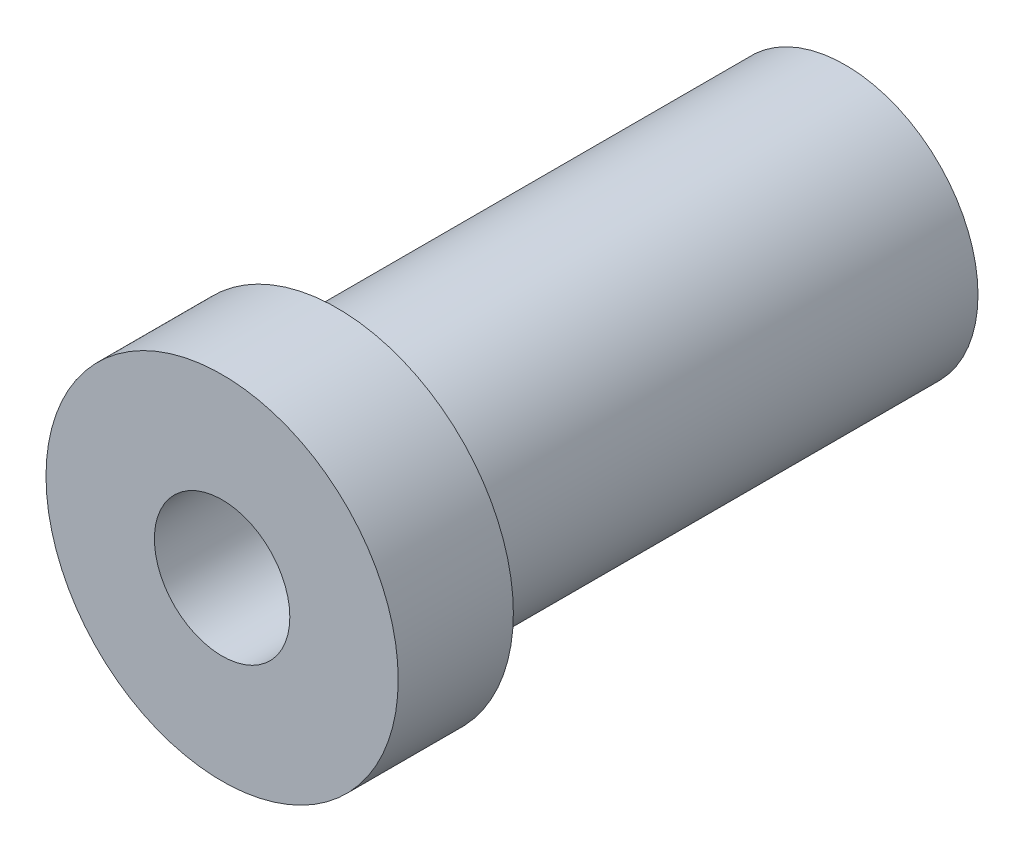
ISO-10303-21;
HEADER;
FILE_DESCRIPTION(('STEP AP214'),'2;1');
FILE_NAME('part.step','',(''),(''),'','','');
FILE_SCHEMA(('AUTOMOTIVE_DESIGN { 1 0 10303 214 1 1 1 1 }'));
ENDSEC;
DATA;
#1=APPLICATION_CONTEXT('core data for automotive mechanical design processes');
#2=APPLICATION_PROTOCOL_DEFINITION('international standard','automotive_design',2000,#1);
#3=PRODUCT_CONTEXT('',#1,'mechanical');
#4=PRODUCT('Part','Part','',(#3));
#5=PRODUCT_RELATED_PRODUCT_CATEGORY('part','',(#4));
#6=PRODUCT_DEFINITION_FORMATION('','',#4);
#7=PRODUCT_DEFINITION_CONTEXT('part definition',#1,'design');
#8=PRODUCT_DEFINITION('design','',#6,#7);
#9=PRODUCT_DEFINITION_SHAPE('','',#8);
#10=(LENGTH_UNIT() NAMED_UNIT(*) SI_UNIT(.MILLI.,.METRE.));
#11=(NAMED_UNIT(*) PLANE_ANGLE_UNIT() SI_UNIT($,.RADIAN.));
#12=(NAMED_UNIT(*) SI_UNIT($,.STERADIAN.) SOLID_ANGLE_UNIT());
#13=UNCERTAINTY_MEASURE_WITH_UNIT(LENGTH_MEASURE(1.E-05),#10,'distance_accuracy_value','');
#14=(GEOMETRIC_REPRESENTATION_CONTEXT(3) GLOBAL_UNCERTAINTY_ASSIGNED_CONTEXT((#13)) GLOBAL_UNIT_ASSIGNED_CONTEXT((#10,
#11,#12)) REPRESENTATION_CONTEXT('',''));
#15=CARTESIAN_POINT('',(0.,0.,0.));
#16=DIRECTION('',(0.,0.,1.));
#17=DIRECTION('',(1.,0.,0.));
#18=AXIS2_PLACEMENT_3D('',#15,#16,#17);
#19=CARTESIAN_POINT('',(0.,4.9,-18.75));
#20=DIRECTION('',(0.,0.,1.));
#21=DIRECTION('',(1.,0.,0.));
#22=AXIS2_PLACEMENT_3D('',#19,#20,#21);
#23=PLANE('',#22);
#24=CARTESIAN_POINT('',(0.,0.,-18.75));
#25=DIRECTION('',(0.,0.,-1.));
#26=DIRECTION('',(-1.,0.,0.));
#27=AXIS2_PLACEMENT_3D('',#24,#25,#26);
#28=CIRCLE('',#27,2.49999999999999);
#29=CARTESIAN_POINT('',(-2.49999999999999,0.,-18.75));
#30=VERTEX_POINT('',#29);
#31=EDGE_CURVE('E68',#30,#30,#28,.T.);
#32=ORIENTED_EDGE('',*,*,#31,.F.);
#33=EDGE_LOOP('',(#32));
#34=FACE_BOUND('',#33,.T.);
#35=CARTESIAN_POINT('',(0.,0.,-18.75));
#36=DIRECTION('',(0.,0.,1.));
#37=DIRECTION('',(1.,0.,0.));
#38=AXIS2_PLACEMENT_3D('',#35,#36,#37);
#39=CIRCLE('',#38,4.9);
#40=CARTESIAN_POINT('',(4.9,0.,-18.75));
#41=VERTEX_POINT('',#40);
#42=EDGE_CURVE('E60',#41,#41,#39,.T.);
#43=ORIENTED_EDGE('',*,*,#42,.F.);
#44=EDGE_LOOP('',(#43));
#45=FACE_BOUND('',#44,.T.);
#46=ADVANCED_FACE('F46',(#34,#45),#23,.F.);
#47=CARTESIAN_POINT('',(0.,0.,4.25));
#48=DIRECTION('',(0.,0.,-1.));
#49=DIRECTION('',(-1.,0.,0.));
#50=AXIS2_PLACEMENT_3D('',#47,#48,#49);
#51=PLANE('',#50);
#52=CARTESIAN_POINT('',(0.,0.,4.25));
#53=DIRECTION('',(0.,0.,1.));
#54=DIRECTION('',(1.,0.,0.));
#55=AXIS2_PLACEMENT_3D('',#52,#53,#54);
#56=CIRCLE('',#55,2.5);
#57=CARTESIAN_POINT('',(2.5,0.,4.25));
#58=VERTEX_POINT('',#57);
#59=EDGE_CURVE('E65',#58,#58,#56,.T.);
#60=ORIENTED_EDGE('',*,*,#59,.F.);
#61=EDGE_LOOP('',(#60));
#62=FACE_BOUND('',#61,.T.);
#63=CARTESIAN_POINT('',(0.,0.,4.24999999999998));
#64=DIRECTION('',(0.,0.,1.));
#65=DIRECTION('',(1.,0.,0.));
#66=AXIS2_PLACEMENT_3D('',#63,#64,#65);
#67=CIRCLE('',#66,6.5);
#68=CARTESIAN_POINT('',(6.5,0.,4.24999999999998));
#69=VERTEX_POINT('',#68);
#70=EDGE_CURVE('E12',#69,#69,#67,.T.);
#71=ORIENTED_EDGE('',*,*,#70,.T.);
#72=EDGE_LOOP('',(#71));
#73=FACE_BOUND('',#72,.T.);
#74=ADVANCED_FACE('F76',(#62,#73),#51,.F.);
#75=CARTESIAN_POINT('',(0.,0.,1000.));
#76=DIRECTION('',(0.,0.,1.));
#77=DIRECTION('',(1.,0.,0.));
#78=AXIS2_PLACEMENT_3D('',#75,#76,#77);
#79=CYLINDRICAL_SURFACE('',#78,6.5);
#80=ORIENTED_EDGE('',*,*,#70,.F.);
#81=EDGE_LOOP('',(#80));
#82=FACE_BOUND('',#81,.T.);
#83=CARTESIAN_POINT('',(0.,0.,0.));
#84=DIRECTION('',(0.,0.,1.));
#85=DIRECTION('',(1.,0.,0.));
#86=AXIS2_PLACEMENT_3D('',#83,#84,#85);
#87=CIRCLE('',#86,6.5);
#88=CARTESIAN_POINT('',(6.5,0.,0.));
#89=VERTEX_POINT('',#88);
#90=EDGE_CURVE('E52',#89,#89,#87,.T.);
#91=ORIENTED_EDGE('',*,*,#90,.T.);
#92=EDGE_LOOP('',(#91));
#93=FACE_BOUND('',#92,.T.);
#94=ADVANCED_FACE('F90',(#82,#93),#79,.T.);
#95=CARTESIAN_POINT('',(0.,6.5,0.));
#96=DIRECTION('',(0.,0.,1.));
#97=DIRECTION('',(1.,0.,0.));
#98=AXIS2_PLACEMENT_3D('',#95,#96,#97);
#99=PLANE('',#98);
#100=ORIENTED_EDGE('',*,*,#90,.F.);
#101=EDGE_LOOP('',(#100));
#102=FACE_BOUND('',#101,.T.);
#103=CARTESIAN_POINT('',(0.,0.,0.));
#104=DIRECTION('',(0.,0.,1.));
#105=DIRECTION('',(1.,0.,0.));
#106=AXIS2_PLACEMENT_3D('',#103,#104,#105);
#107=CIRCLE('',#106,4.9);
#108=CARTESIAN_POINT('',(4.9,0.,0.));
#109=VERTEX_POINT('',#108);
#110=EDGE_CURVE('E56',#109,#109,#107,.T.);
#111=ORIENTED_EDGE('',*,*,#110,.T.);
#112=EDGE_LOOP('',(#111));
#113=FACE_BOUND('',#112,.T.);
#114=ADVANCED_FACE('F81',(#102,#113),#99,.F.);
#115=CARTESIAN_POINT('',(0.,0.,1000.));
#116=DIRECTION('',(0.,0.,1.));
#117=DIRECTION('',(1.,0.,0.));
#118=AXIS2_PLACEMENT_3D('',#115,#116,#117);
#119=CYLINDRICAL_SURFACE('',#118,4.9);
#120=ORIENTED_EDGE('',*,*,#110,.F.);
#121=EDGE_LOOP('',(#120));
#122=FACE_BOUND('',#121,.T.);
#123=ORIENTED_EDGE('',*,*,#42,.T.);
#124=EDGE_LOOP('',(#123));
#125=FACE_BOUND('',#124,.T.);
#126=ADVANCED_FACE('F79',(#122,#125),#119,.T.);
#127=CARTESIAN_POINT('',(0.,0.,4.25));
#128=DIRECTION('',(0.,0.,1.));
#129=DIRECTION('',(1.,0.,0.));
#130=AXIS2_PLACEMENT_3D('',#127,#128,#129);
#131=CYLINDRICAL_SURFACE('',#130,2.5);
#132=ORIENTED_EDGE('',*,*,#59,.T.);
#133=EDGE_LOOP('',(#132));
#134=FACE_BOUND('',#133,.T.);
#135=ORIENTED_EDGE('',*,*,#31,.T.);
#136=EDGE_LOOP('',(#135));
#137=FACE_BOUND('',#136,.T.);
#138=ADVANCED_FACE('F72',(#134,#137),#131,.F.);
#139=CLOSED_SHELL('',(#46,#74,#94,#114,#126,#138));
#140=MANIFOLD_SOLID_BREP('B2',#139);
#141=ADVANCED_BREP_SHAPE_REPRESENTATION('',(#18,#140),#14);
#142=SHAPE_DEFINITION_REPRESENTATION(#9,#141);
ENDSEC;
END-ISO-10303-21;
